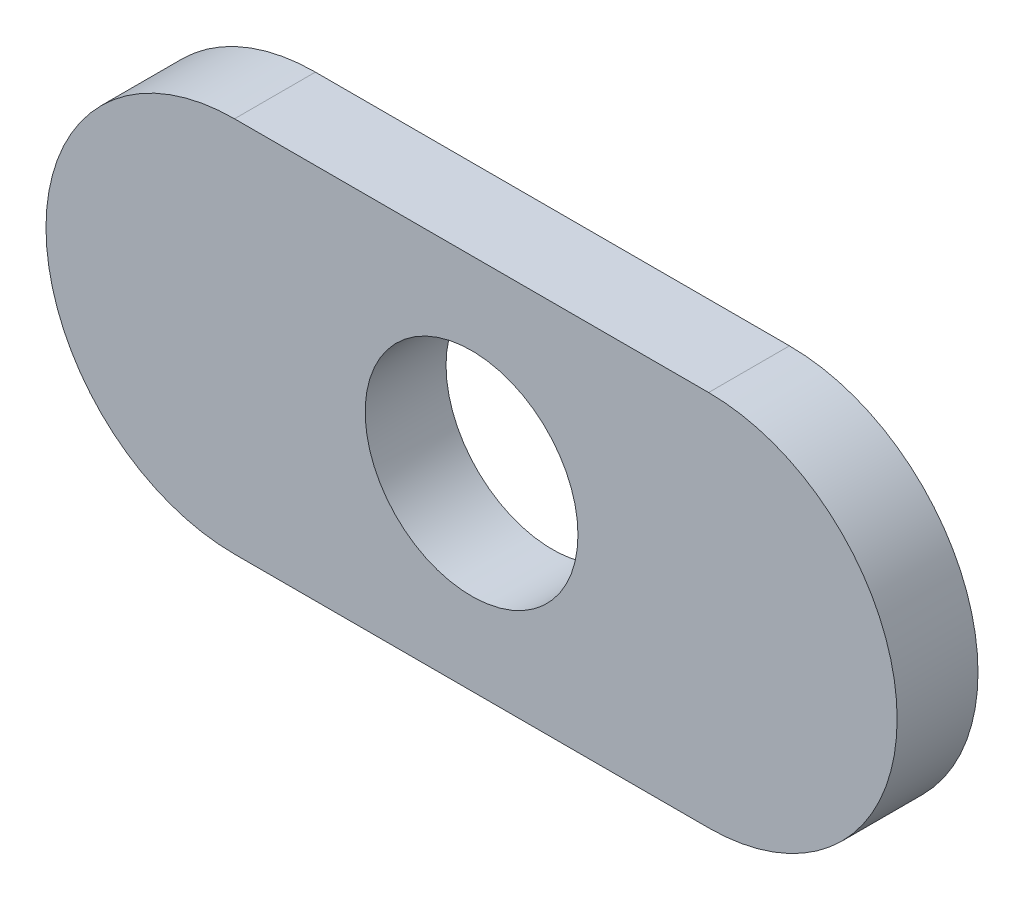
ISO-10303-21;
HEADER;
FILE_DESCRIPTION(('STEP AP214'),'2;1');
FILE_NAME('part.step','',(''),(''),'','','');
FILE_SCHEMA(('AUTOMOTIVE_DESIGN { 1 0 10303 214 1 1 1 1 }'));
ENDSEC;
DATA;
#1=APPLICATION_CONTEXT('core data for automotive mechanical design processes');
#2=APPLICATION_PROTOCOL_DEFINITION('international standard','automotive_design',2000,#1);
#3=PRODUCT_CONTEXT('',#1,'mechanical');
#4=PRODUCT('Part','Part','',(#3));
#5=PRODUCT_RELATED_PRODUCT_CATEGORY('part','',(#4));
#6=PRODUCT_DEFINITION_FORMATION('','',#4);
#7=PRODUCT_DEFINITION_CONTEXT('part definition',#1,'design');
#8=PRODUCT_DEFINITION('design','',#6,#7);
#9=PRODUCT_DEFINITION_SHAPE('','',#8);
#10=(LENGTH_UNIT() NAMED_UNIT(*) SI_UNIT(.MILLI.,.METRE.));
#11=(NAMED_UNIT(*) PLANE_ANGLE_UNIT() SI_UNIT($,.RADIAN.));
#12=(NAMED_UNIT(*) SI_UNIT($,.STERADIAN.) SOLID_ANGLE_UNIT());
#13=UNCERTAINTY_MEASURE_WITH_UNIT(LENGTH_MEASURE(1.E-05),#10,'distance_accuracy_value','');
#14=(GEOMETRIC_REPRESENTATION_CONTEXT(3) GLOBAL_UNCERTAINTY_ASSIGNED_CONTEXT((#13)) GLOBAL_UNIT_ASSIGNED_CONTEXT((#10,
#11,#12)) REPRESENTATION_CONTEXT('',''));
#15=CARTESIAN_POINT('',(0.,0.,0.));
#16=DIRECTION('',(0.,0.,1.));
#17=DIRECTION('',(1.,0.,0.));
#18=AXIS2_PLACEMENT_3D('',#15,#16,#17);
#19=CARTESIAN_POINT('',(111.278662660247,125.933065895994,2.413));
#20=DIRECTION('',(0.,0.,-1.));
#21=DIRECTION('',(-1.,0.,0.));
#22=AXIS2_PLACEMENT_3D('',#19,#20,#21);
#23=CYLINDRICAL_SURFACE('',#22,5.62609999999999);
#24=CARTESIAN_POINT('',(111.278662660247,125.933065895994,0.));
#25=DIRECTION('',(0.,0.,1.));
#26=DIRECTION('',(-1.,0.,0.));
#27=AXIS2_PLACEMENT_3D('',#24,#25,#26);
#28=CIRCLE('',#27,5.62609999999999);
#29=CARTESIAN_POINT('',(111.278662660247,131.559165895994,0.));
#30=VERTEX_POINT('',#29);
#31=CARTESIAN_POINT('',(111.278662660247,120.306965895994,0.));
#32=VERTEX_POINT('',#31);
#33=EDGE_CURVE('E98',#30,#32,#28,.T.);
#34=ORIENTED_EDGE('',*,*,#33,.T.);
#35=DIRECTION('',(0.,0.,-1.));
#36=VECTOR('',#35,1.);
#37=CARTESIAN_POINT('',(111.278662660247,120.306965895994,2.413));
#38=LINE('',#37,#36);
#39=CARTESIAN_POINT('',(111.278662660247,120.306965895994,2.413));
#40=VERTEX_POINT('',#39);
#41=EDGE_CURVE('E11',#40,#32,#38,.T.);
#42=ORIENTED_EDGE('',*,*,#41,.F.);
#43=CARTESIAN_POINT('',(111.278662660247,125.933065895994,2.413));
#44=DIRECTION('',(0.,0.,1.));
#45=DIRECTION('',(-1.,0.,0.));
#46=AXIS2_PLACEMENT_3D('',#43,#44,#45);
#47=CIRCLE('',#46,5.62609999999999);
#48=CARTESIAN_POINT('',(111.278662660247,131.559165895994,2.413));
#49=VERTEX_POINT('',#48);
#50=EDGE_CURVE('E86',#49,#40,#47,.T.);
#51=ORIENTED_EDGE('',*,*,#50,.F.);
#52=DIRECTION('',(0.,0.,-1.));
#53=VECTOR('',#52,1.);
#54=CARTESIAN_POINT('',(111.278662660247,131.559165895994,2.413));
#55=LINE('',#54,#53);
#56=EDGE_CURVE('E94',#49,#30,#55,.T.);
#57=ORIENTED_EDGE('',*,*,#56,.T.);
#58=EDGE_LOOP('',(#34,#42,#51,#57));
#59=FACE_BOUND('',#58,.T.);
#60=ADVANCED_FACE('F35',(#59),#23,.T.);
#61=CARTESIAN_POINT('',(111.278662660247,120.306965895994,2.413));
#62=DIRECTION('',(0.,1.,0.));
#63=DIRECTION('',(0.,0.,1.));
#64=AXIS2_PLACEMENT_3D('',#61,#62,#63);
#65=PLANE('',#64);
#66=DIRECTION('',(1.,0.,0.));
#67=VECTOR('',#66,1.);
#68=CARTESIAN_POINT('',(111.278662660247,120.306965895994,0.));
#69=LINE('',#68,#67);
#70=CARTESIAN_POINT('',(125.426462660247,120.306965895994,0.));
#71=VERTEX_POINT('',#70);
#72=EDGE_CURVE('E90',#32,#71,#69,.T.);
#73=ORIENTED_EDGE('',*,*,#72,.T.);
#74=DIRECTION('',(0.,0.,-1.));
#75=VECTOR('',#74,1.);
#76=CARTESIAN_POINT('',(125.426462660247,120.306965895994,2.413));
#77=LINE('',#76,#75);
#78=CARTESIAN_POINT('',(125.426462660247,120.306965895994,2.413));
#79=VERTEX_POINT('',#78);
#80=EDGE_CURVE('E43',#79,#71,#77,.T.);
#81=ORIENTED_EDGE('',*,*,#80,.F.);
#82=DIRECTION('',(1.,0.,0.));
#83=VECTOR('',#82,1.);
#84=CARTESIAN_POINT('',(111.278662660247,120.306965895994,2.413));
#85=LINE('',#84,#83);
#86=EDGE_CURVE('E81',#40,#79,#85,.T.);
#87=ORIENTED_EDGE('',*,*,#86,.F.);
#88=ORIENTED_EDGE('',*,*,#41,.T.);
#89=EDGE_LOOP('',(#73,#81,#87,#88));
#90=FACE_BOUND('',#89,.T.);
#91=ADVANCED_FACE('F89',(#90),#65,.F.);
#92=CARTESIAN_POINT('',(125.426462660247,125.933065895994,2.413));
#93=DIRECTION('',(0.,0.,-1.));
#94=DIRECTION('',(-1.,0.,0.));
#95=AXIS2_PLACEMENT_3D('',#92,#93,#94);
#96=CYLINDRICAL_SURFACE('',#95,5.62609999999999);
#97=CARTESIAN_POINT('',(125.426462660247,125.933065895994,0.));
#98=DIRECTION('',(0.,0.,1.));
#99=DIRECTION('',(1.,0.,0.));
#100=AXIS2_PLACEMENT_3D('',#97,#98,#99);
#101=CIRCLE('',#100,5.62609999999999);
#102=CARTESIAN_POINT('',(125.426462660247,131.559165895994,0.));
#103=VERTEX_POINT('',#102);
#104=EDGE_CURVE('E68',#71,#103,#101,.T.);
#105=ORIENTED_EDGE('',*,*,#104,.T.);
#106=DIRECTION('',(0.,0.,-1.));
#107=VECTOR('',#106,1.);
#108=CARTESIAN_POINT('',(125.426462660247,131.559165895994,2.413));
#109=LINE('',#108,#107);
#110=CARTESIAN_POINT('',(125.426462660247,131.559165895994,2.413));
#111=VERTEX_POINT('',#110);
#112=EDGE_CURVE('E91',#111,#103,#109,.T.);
#113=ORIENTED_EDGE('',*,*,#112,.F.);
#114=CARTESIAN_POINT('',(125.426462660247,125.933065895994,2.413));
#115=DIRECTION('',(0.,0.,1.));
#116=DIRECTION('',(1.,0.,0.));
#117=AXIS2_PLACEMENT_3D('',#114,#115,#116);
#118=CIRCLE('',#117,5.62609999999999);
#119=EDGE_CURVE('E84',#79,#111,#118,.T.);
#120=ORIENTED_EDGE('',*,*,#119,.F.);
#121=ORIENTED_EDGE('',*,*,#80,.T.);
#122=EDGE_LOOP('',(#105,#113,#120,#121));
#123=FACE_BOUND('',#122,.T.);
#124=ADVANCED_FACE('F92',(#123),#96,.T.);
#125=CARTESIAN_POINT('',(111.278662660247,131.559165895994,2.413));
#126=DIRECTION('',(0.,-1.,0.));
#127=DIRECTION('',(0.,0.,-1.));
#128=AXIS2_PLACEMENT_3D('',#125,#126,#127);
#129=PLANE('',#128);
#130=DIRECTION('',(-1.,0.,0.));
#131=VECTOR('',#130,1.);
#132=CARTESIAN_POINT('',(111.278662660247,131.559165895994,0.));
#133=LINE('',#132,#131);
#134=EDGE_CURVE('E74',#103,#30,#133,.T.);
#135=ORIENTED_EDGE('',*,*,#134,.T.);
#136=ORIENTED_EDGE('',*,*,#56,.F.);
#137=DIRECTION('',(-1.,0.,0.));
#138=VECTOR('',#137,1.);
#139=CARTESIAN_POINT('',(111.278662660247,131.559165895994,2.413));
#140=LINE('',#139,#138);
#141=EDGE_CURVE('E51',#111,#49,#140,.T.);
#142=ORIENTED_EDGE('',*,*,#141,.F.);
#143=ORIENTED_EDGE('',*,*,#112,.T.);
#144=EDGE_LOOP('',(#135,#136,#142,#143));
#145=FACE_BOUND('',#144,.T.);
#146=ADVANCED_FACE('F106',(#145),#129,.F.);
#147=CARTESIAN_POINT('',(111.278662660247,125.933065895994,2.413));
#148=DIRECTION('',(0.,0.,-1.));
#149=DIRECTION('',(-1.,0.,0.));
#150=AXIS2_PLACEMENT_3D('',#147,#148,#149);
#151=PLANE('',#150);
#152=CARTESIAN_POINT('',(118.352562660247,125.933065895994,2.413));
#153=DIRECTION('',(0.,0.,1.));
#154=DIRECTION('',(1.,0.,0.));
#155=AXIS2_PLACEMENT_3D('',#152,#153,#154);
#156=CIRCLE('',#155,3.175);
#157=CARTESIAN_POINT('',(121.527562660247,125.933065895994,2.413));
#158=VERTEX_POINT('',#157);
#159=EDGE_CURVE('E101',#158,#158,#156,.T.);
#160=ORIENTED_EDGE('',*,*,#159,.F.);
#161=EDGE_LOOP('',(#160));
#162=FACE_BOUND('',#161,.T.);
#163=ORIENTED_EDGE('',*,*,#50,.T.);
#164=ORIENTED_EDGE('',*,*,#86,.T.);
#165=ORIENTED_EDGE('',*,*,#119,.T.);
#166=ORIENTED_EDGE('',*,*,#141,.T.);
#167=EDGE_LOOP('',(#163,#164,#165,#166));
#168=FACE_BOUND('',#167,.T.);
#169=ADVANCED_FACE('F82',(#162,#168),#151,.F.);
#170=CARTESIAN_POINT('',(111.278662660247,125.933065895994,0.));
#171=DIRECTION('',(0.,0.,-1.));
#172=DIRECTION('',(-1.,0.,0.));
#173=AXIS2_PLACEMENT_3D('',#170,#171,#172);
#174=PLANE('',#173);
#175=CARTESIAN_POINT('',(118.352562660247,125.933065895994,0.));
#176=DIRECTION('',(0.,0.,-1.));
#177=DIRECTION('',(-1.,0.,0.));
#178=AXIS2_PLACEMENT_3D('',#175,#176,#177);
#179=CIRCLE('',#178,3.175);
#180=CARTESIAN_POINT('',(115.177562660247,125.933065895994,0.));
#181=VERTEX_POINT('',#180);
#182=EDGE_CURVE('E112',#181,#181,#179,.F.);
#183=ORIENTED_EDGE('',*,*,#182,.T.);
#184=EDGE_LOOP('',(#183));
#185=FACE_BOUND('',#184,.T.);
#186=ORIENTED_EDGE('',*,*,#33,.F.);
#187=ORIENTED_EDGE('',*,*,#134,.F.);
#188=ORIENTED_EDGE('',*,*,#104,.F.);
#189=ORIENTED_EDGE('',*,*,#72,.F.);
#190=EDGE_LOOP('',(#186,#187,#188,#189));
#191=FACE_BOUND('',#190,.T.);
#192=ADVANCED_FACE('F109',(#185,#191),#174,.T.);
#193=CARTESIAN_POINT('',(118.352562660247,125.933065895994,-0.00100000000000013));
#194=DIRECTION('',(0.,0.,1.));
#195=DIRECTION('',(1.,0.,0.));
#196=AXIS2_PLACEMENT_3D('',#193,#194,#195);
#197=CYLINDRICAL_SURFACE('',#196,3.175);
#198=ORIENTED_EDGE('',*,*,#182,.F.);
#199=EDGE_LOOP('',(#198));
#200=FACE_BOUND('',#199,.T.);
#201=ORIENTED_EDGE('',*,*,#159,.T.);
#202=EDGE_LOOP('',(#201));
#203=FACE_BOUND('',#202,.T.);
#204=ADVANCED_FACE('F118',(#200,#203),#197,.F.);
#205=CLOSED_SHELL('',(#60,#91,#124,#146,#169,#192,#204));
#206=MANIFOLD_SOLID_BREP('B2',#205);
#207=ADVANCED_BREP_SHAPE_REPRESENTATION('',(#18,#206),#14);
#208=SHAPE_DEFINITION_REPRESENTATION(#9,#207);
ENDSEC;
END-ISO-10303-21;
